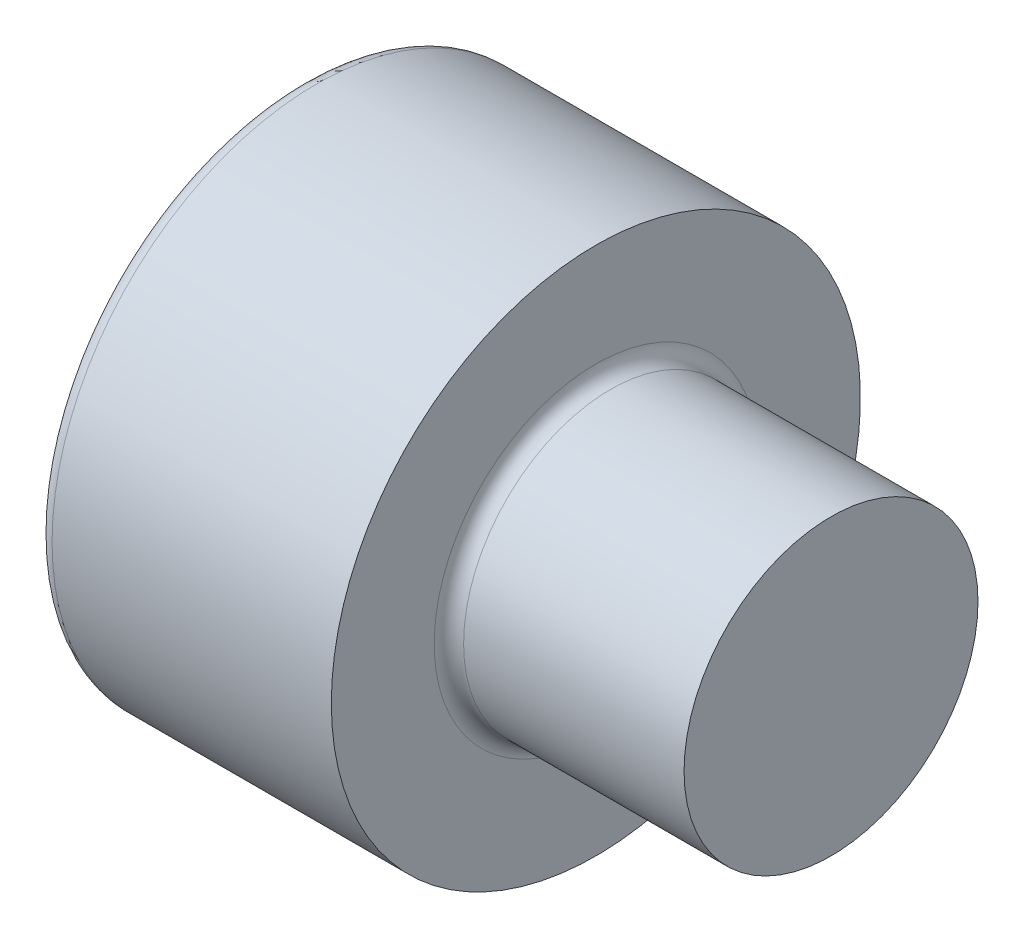
ISO-10303-21;
HEADER;
FILE_DESCRIPTION(('STEP AP214'),'2;1');
FILE_NAME('part.step','',(''),(''),'','','');
FILE_SCHEMA(('AUTOMOTIVE_DESIGN { 1 0 10303 214 1 1 1 1 }'));
ENDSEC;
DATA;
#1=APPLICATION_CONTEXT('core data for automotive mechanical design processes');
#2=APPLICATION_PROTOCOL_DEFINITION('international standard','automotive_design',2000,#1);
#3=PRODUCT_CONTEXT('',#1,'mechanical');
#4=PRODUCT('Part','Part','',(#3));
#5=PRODUCT_RELATED_PRODUCT_CATEGORY('part','',(#4));
#6=PRODUCT_DEFINITION_FORMATION('','',#4);
#7=PRODUCT_DEFINITION_CONTEXT('part definition',#1,'design');
#8=PRODUCT_DEFINITION('design','',#6,#7);
#9=PRODUCT_DEFINITION_SHAPE('','',#8);
#10=(LENGTH_UNIT() NAMED_UNIT(*) SI_UNIT(.MILLI.,.METRE.));
#11=(NAMED_UNIT(*) PLANE_ANGLE_UNIT() SI_UNIT($,.RADIAN.));
#12=(NAMED_UNIT(*) SI_UNIT($,.STERADIAN.) SOLID_ANGLE_UNIT());
#13=UNCERTAINTY_MEASURE_WITH_UNIT(LENGTH_MEASURE(1.E-05),#10,'distance_accuracy_value','');
#14=(GEOMETRIC_REPRESENTATION_CONTEXT(3) GLOBAL_UNCERTAINTY_ASSIGNED_CONTEXT((#13)) GLOBAL_UNIT_ASSIGNED_CONTEXT((#10,
#11,#12)) REPRESENTATION_CONTEXT('',''));
#15=CARTESIAN_POINT('',(0.,0.,0.));
#16=DIRECTION('',(0.,0.,1.));
#17=DIRECTION('',(1.,0.,0.));
#18=AXIS2_PLACEMENT_3D('',#15,#16,#17);
#19=CARTESIAN_POINT('',(10.5,0.,0.));
#20=DIRECTION('',(-1.,0.,0.));
#21=DIRECTION('',(0.,0.,1.));
#22=AXIS2_PLACEMENT_3D('',#19,#20,#21);
#23=CYLINDRICAL_SURFACE('',#22,1.25);
#24=CARTESIAN_POINT('',(2.625,0.,0.));
#25=DIRECTION('',(1.,0.,0.));
#26=DIRECTION('',(0.,0.,-1.));
#27=AXIS2_PLACEMENT_3D('',#24,#25,#26);
#28=CIRCLE('',#27,1.25);
#29=CARTESIAN_POINT('',(2.625,0.,-1.25));
#30=VERTEX_POINT('',#29);
#31=EDGE_CURVE('E174',#30,#30,#28,.T.);
#32=ORIENTED_EDGE('',*,*,#31,.T.);
#33=EDGE_LOOP('',(#32));
#34=FACE_BOUND('',#33,.T.);
#35=CARTESIAN_POINT('',(4.5,0.,0.));
#36=DIRECTION('',(1.,0.,0.));
#37=DIRECTION('',(0.,0.,-1.));
#38=AXIS2_PLACEMENT_3D('',#35,#36,#37);
#39=CIRCLE('',#38,1.25);
#40=CARTESIAN_POINT('',(4.5,0.,-1.25));
#41=VERTEX_POINT('',#40);
#42=EDGE_CURVE('E39',#41,#41,#39,.T.);
#43=ORIENTED_EDGE('',*,*,#42,.F.);
#44=EDGE_LOOP('',(#43));
#45=FACE_BOUND('',#44,.T.);
#46=ADVANCED_FACE('F35',(#34,#45),#23,.T.);
#47=CARTESIAN_POINT('',(1.1,0.,0.));
#48=DIRECTION('',(-1.,0.,0.));
#49=DIRECTION('',(0.,0.,1.));
#50=AXIS2_PLACEMENT_3D('',#47,#48,#49);
#51=PLANE('',#50);
#52=DIRECTION('',(0.,-1.,0.));
#53=VECTOR('',#52,1.);
#54=CARTESIAN_POINT('',(1.1,0.590340650246388,-1.0225));
#55=LINE('',#54,#53);
#56=CARTESIAN_POINT('',(1.1,0.590340650246388,-1.0225));
#57=VERTEX_POINT('',#56);
#58=CARTESIAN_POINT('',(1.10000000000581,0.,-1.0225));
#59=VERTEX_POINT('',#58);
#60=EDGE_CURVE('E226',#57,#59,#55,.T.);
#61=ORIENTED_EDGE('',*,*,#60,.T.);
#62=CARTESIAN_POINT('',(1.10000000000581,0.,0.));
#63=DIRECTION('',(1.,0.,0.));
#64=DIRECTION('',(0.,0.,-1.));
#65=AXIS2_PLACEMENT_3D('',#62,#63,#64);
#66=CIRCLE('',#65,1.02250000003191);
#67=CARTESIAN_POINT('',(1.10000000000581,0.885510975397226,-0.511250000015958));
#68=VERTEX_POINT('',#67);
#69=EDGE_CURVE('E51',#59,#68,#66,.T.);
#70=ORIENTED_EDGE('',*,*,#69,.T.);
#71=DIRECTION('',(0.,-0.500000000000001,-0.866025403784438));
#72=VECTOR('',#71,1.);
#73=CARTESIAN_POINT('',(1.1,1.18068130049278,0.));
#74=LINE('',#73,#72);
#75=EDGE_CURVE('E239',#68,#57,#74,.T.);
#76=ORIENTED_EDGE('',*,*,#75,.T.);
#77=EDGE_LOOP('',(#61,#70,#76));
#78=FACE_BOUND('',#77,.T.);
#79=ADVANCED_FACE('F122',(#78),#51,.T.);
#80=CARTESIAN_POINT('',(1.1,1.18068130049278,0.));
#81=VERTEX_POINT('',#80);
#82=EDGE_CURVE('E240',#81,#68,#74,.T.);
#83=ORIENTED_EDGE('',*,*,#82,.T.);
#84=CARTESIAN_POINT('',(1.10000000000581,0.885510975397227,0.511250000015956));
#85=VERTEX_POINT('',#84);
#86=EDGE_CURVE('E177',#68,#85,#66,.T.);
#87=ORIENTED_EDGE('',*,*,#86,.T.);
#88=DIRECTION('',(0.,0.499999999999999,-0.866025403784439));
#89=VECTOR('',#88,1.);
#90=CARTESIAN_POINT('',(1.1,0.59034065024639,1.0225));
#91=LINE('',#90,#89);
#92=EDGE_CURVE('E236',#85,#81,#91,.T.);
#93=ORIENTED_EDGE('',*,*,#92,.T.);
#94=EDGE_LOOP('',(#83,#87,#93));
#95=FACE_BOUND('',#94,.T.);
#96=ADVANCED_FACE('F133',(#95),#51,.T.);
#97=CARTESIAN_POINT('',(1.1,0.59034065024639,1.0225));
#98=VERTEX_POINT('',#97);
#99=EDGE_CURVE('E237',#98,#85,#91,.T.);
#100=ORIENTED_EDGE('',*,*,#99,.T.);
#101=CARTESIAN_POINT('',(1.10000000000581,0.,1.02250000003191));
#102=VERTEX_POINT('',#101);
#103=EDGE_CURVE('E200',#85,#102,#66,.T.);
#104=ORIENTED_EDGE('',*,*,#103,.T.);
#105=DIRECTION('',(0.,1.,0.));
#106=VECTOR('',#105,1.);
#107=CARTESIAN_POINT('',(1.1,-0.590340650246394,1.0225));
#108=LINE('',#107,#106);
#109=EDGE_CURVE('E233',#102,#98,#108,.T.);
#110=ORIENTED_EDGE('',*,*,#109,.T.);
#111=EDGE_LOOP('',(#100,#104,#110));
#112=FACE_BOUND('',#111,.T.);
#113=ADVANCED_FACE('F272',(#112),#51,.T.);
#114=CARTESIAN_POINT('',(1.1,-0.590340650246394,1.0225));
#115=VERTEX_POINT('',#114);
#116=EDGE_CURVE('E234',#115,#102,#108,.T.);
#117=ORIENTED_EDGE('',*,*,#116,.T.);
#118=CARTESIAN_POINT('',(1.10000000000581,-0.885510975397226,0.511250000015958));
#119=VERTEX_POINT('',#118);
#120=EDGE_CURVE('E205',#102,#119,#66,.T.);
#121=ORIENTED_EDGE('',*,*,#120,.T.);
#122=DIRECTION('',(0.,0.500000000000001,0.866025403784438));
#123=VECTOR('',#122,1.);
#124=CARTESIAN_POINT('',(1.1,-1.18068130049279,0.));
#125=LINE('',#124,#123);
#126=EDGE_CURVE('E230',#119,#115,#125,.T.);
#127=ORIENTED_EDGE('',*,*,#126,.T.);
#128=EDGE_LOOP('',(#117,#121,#127));
#129=FACE_BOUND('',#128,.T.);
#130=ADVANCED_FACE('F155',(#129),#51,.T.);
#131=CARTESIAN_POINT('',(1.1,-1.18068130049279,0.));
#132=VERTEX_POINT('',#131);
#133=EDGE_CURVE('E219',#132,#119,#125,.T.);
#134=ORIENTED_EDGE('',*,*,#133,.T.);
#135=CARTESIAN_POINT('',(1.10000000000581,-0.885510975397228,-0.511250000015955));
#136=VERTEX_POINT('',#135);
#137=EDGE_CURVE('E166',#119,#136,#66,.T.);
#138=ORIENTED_EDGE('',*,*,#137,.T.);
#139=DIRECTION('',(0.,-0.499999999999999,0.86602540378444));
#140=VECTOR('',#139,1.);
#141=CARTESIAN_POINT('',(1.1,-0.590340650246397,-1.0225));
#142=LINE('',#141,#140);
#143=EDGE_CURVE('E216',#136,#132,#142,.T.);
#144=ORIENTED_EDGE('',*,*,#143,.T.);
#145=EDGE_LOOP('',(#134,#138,#144));
#146=FACE_BOUND('',#145,.T.);
#147=ADVANCED_FACE('F123',(#146),#51,.T.);
#148=CARTESIAN_POINT('',(2.5,0.,0.));
#149=DIRECTION('',(-1.,0.,0.));
#150=DIRECTION('',(0.,0.,1.));
#151=AXIS2_PLACEMENT_3D('',#148,#149,#150);
#152=CYLINDRICAL_SURFACE('',#151,2.25);
#153=CARTESIAN_POINT('',(0.125,0.,0.));
#154=DIRECTION('',(-1.,0.,0.));
#155=DIRECTION('',(0.,0.,1.));
#156=AXIS2_PLACEMENT_3D('',#153,#154,#155);
#157=CIRCLE('',#156,2.25);
#158=CARTESIAN_POINT('',(0.125,0.,2.25));
#159=VERTEX_POINT('',#158);
#160=EDGE_CURVE('E11',#159,#159,#157,.F.);
#161=ORIENTED_EDGE('',*,*,#160,.T.);
#162=EDGE_LOOP('',(#161));
#163=FACE_BOUND('',#162,.T.);
#164=CARTESIAN_POINT('',(2.5,0.,0.));
#165=DIRECTION('',(-1.,0.,0.));
#166=DIRECTION('',(0.,0.,1.));
#167=AXIS2_PLACEMENT_3D('',#164,#165,#166);
#168=CIRCLE('',#167,2.25);
#169=CARTESIAN_POINT('',(2.5,0.,2.25));
#170=VERTEX_POINT('',#169);
#171=EDGE_CURVE('E161',#170,#170,#168,.T.);
#172=ORIENTED_EDGE('',*,*,#171,.T.);
#173=EDGE_LOOP('',(#172));
#174=FACE_BOUND('',#173,.T.);
#175=ADVANCED_FACE('F148',(#163,#174),#152,.T.);
#176=CARTESIAN_POINT('',(2.5,2.25,0.));
#177=DIRECTION('',(1.,0.,0.));
#178=DIRECTION('',(0.,0.,-1.));
#179=AXIS2_PLACEMENT_3D('',#176,#177,#178);
#180=PLANE('',#179);
#181=CARTESIAN_POINT('',(2.5,0.,0.));
#182=DIRECTION('',(1.,0.,0.));
#183=DIRECTION('',(0.,0.,-1.));
#184=AXIS2_PLACEMENT_3D('',#181,#182,#183);
#185=CIRCLE('',#184,1.375);
#186=CARTESIAN_POINT('',(2.5,0.,-1.375));
#187=VERTEX_POINT('',#186);
#188=EDGE_CURVE('E176',#187,#187,#185,.F.);
#189=ORIENTED_EDGE('',*,*,#188,.T.);
#190=EDGE_LOOP('',(#189));
#191=FACE_BOUND('',#190,.T.);
#192=ORIENTED_EDGE('',*,*,#171,.F.);
#193=EDGE_LOOP('',(#192));
#194=FACE_BOUND('',#193,.T.);
#195=ADVANCED_FACE('F144',(#191,#194),#180,.T.);
#196=CARTESIAN_POINT('',(0.,0.,0.));
#197=DIRECTION('',(-1.,0.,0.));
#198=DIRECTION('',(0.,0.,1.));
#199=AXIS2_PLACEMENT_3D('',#196,#197,#198);
#200=PLANE('',#199);
#201=CARTESIAN_POINT('',(0.,0.,0.));
#202=DIRECTION('',(-1.,0.,0.));
#203=DIRECTION('',(0.,0.,1.));
#204=AXIS2_PLACEMENT_3D('',#201,#202,#203);
#205=CIRCLE('',#204,2.125);
#206=CARTESIAN_POINT('',(0.,0.,2.125));
#207=VERTEX_POINT('',#206);
#208=EDGE_CURVE('E44',#207,#207,#205,.T.);
#209=ORIENTED_EDGE('',*,*,#208,.T.);
#210=EDGE_LOOP('',(#209));
#211=FACE_BOUND('',#210,.T.);
#212=DIRECTION('',(0.,-1.,0.));
#213=VECTOR('',#212,1.);
#214=CARTESIAN_POINT('',(0.,0.590340650246388,-1.0225));
#215=LINE('',#214,#213);
#216=CARTESIAN_POINT('',(0.,0.590340650246388,-1.0225));
#217=VERTEX_POINT('',#216);
#218=CARTESIAN_POINT('',(0.,-0.590340650246397,-1.0225));
#219=VERTEX_POINT('',#218);
#220=EDGE_CURVE('E59',#217,#219,#215,.T.);
#221=ORIENTED_EDGE('',*,*,#220,.F.);
#222=DIRECTION('',(0.,-0.500000000000001,-0.866025403784438));
#223=VECTOR('',#222,1.);
#224=CARTESIAN_POINT('',(0.,1.18068130049278,0.));
#225=LINE('',#224,#223);
#226=CARTESIAN_POINT('',(0.,1.18068130049278,0.));
#227=VERTEX_POINT('',#226);
#228=EDGE_CURVE('E252',#227,#217,#225,.T.);
#229=ORIENTED_EDGE('',*,*,#228,.F.);
#230=DIRECTION('',(0.,0.499999999999999,-0.866025403784439));
#231=VECTOR('',#230,1.);
#232=CARTESIAN_POINT('',(0.,0.59034065024639,1.0225));
#233=LINE('',#232,#231);
#234=CARTESIAN_POINT('',(0.,0.59034065024639,1.0225));
#235=VERTEX_POINT('',#234);
#236=EDGE_CURVE('E249',#235,#227,#233,.T.);
#237=ORIENTED_EDGE('',*,*,#236,.F.);
#238=DIRECTION('',(0.,1.,0.));
#239=VECTOR('',#238,1.);
#240=CARTESIAN_POINT('',(0.,-0.590340650246394,1.0225));
#241=LINE('',#240,#239);
#242=CARTESIAN_POINT('',(0.,-0.590340650246394,1.0225));
#243=VERTEX_POINT('',#242);
#244=EDGE_CURVE('E246',#243,#235,#241,.T.);
#245=ORIENTED_EDGE('',*,*,#244,.F.);
#246=DIRECTION('',(0.,0.500000000000001,0.866025403784438));
#247=VECTOR('',#246,1.);
#248=CARTESIAN_POINT('',(0.,-1.18068130049279,0.));
#249=LINE('',#248,#247);
#250=CARTESIAN_POINT('',(0.,-1.18068130049279,0.));
#251=VERTEX_POINT('',#250);
#252=EDGE_CURVE('E243',#251,#243,#249,.T.);
#253=ORIENTED_EDGE('',*,*,#252,.F.);
#254=DIRECTION('',(0.,-0.499999999999999,0.86602540378444));
#255=VECTOR('',#254,1.);
#256=CARTESIAN_POINT('',(0.,-0.590340650246397,-1.0225));
#257=LINE('',#256,#255);
#258=EDGE_CURVE('E196',#219,#251,#257,.T.);
#259=ORIENTED_EDGE('',*,*,#258,.F.);
#260=EDGE_LOOP('',(#221,#229,#237,#245,#253,#259));
#261=FACE_BOUND('',#260,.T.);
#262=ADVANCED_FACE('F141',(#211,#261),#200,.T.);
#263=CARTESIAN_POINT('',(1.1,0.590340650246388,-1.0225));
#264=DIRECTION('',(0.,0.,-1.));
#265=DIRECTION('',(0.,1.,0.));
#266=AXIS2_PLACEMENT_3D('',#263,#264,#265);
#267=PLANE('',#266);
#268=ORIENTED_EDGE('',*,*,#220,.T.);
#269=DIRECTION('',(-1.,0.,0.));
#270=VECTOR('',#269,1.);
#271=CARTESIAN_POINT('',(1.1,-0.590340650246397,-1.0225));
#272=LINE('',#271,#270);
#273=CARTESIAN_POINT('',(1.1,-0.590340650246397,-1.0225));
#274=VERTEX_POINT('',#273);
#275=EDGE_CURVE('E172',#274,#219,#272,.T.);
#276=ORIENTED_EDGE('',*,*,#275,.F.);
#277=EDGE_CURVE('E229',#59,#274,#55,.T.);
#278=ORIENTED_EDGE('',*,*,#277,.F.);
#279=ORIENTED_EDGE('',*,*,#60,.F.);
#280=DIRECTION('',(-1.,0.,0.));
#281=VECTOR('',#280,1.);
#282=CARTESIAN_POINT('',(1.1,0.590340650246388,-1.0225));
#283=LINE('',#282,#281);
#284=EDGE_CURVE('E164',#57,#217,#283,.T.);
#285=ORIENTED_EDGE('',*,*,#284,.T.);
#286=EDGE_LOOP('',(#268,#276,#278,#279,#285));
#287=FACE_BOUND('',#286,.T.);
#288=ADVANCED_FACE('F139',(#287),#267,.F.);
#289=CARTESIAN_POINT('',(1.1,1.18068130049278,0.));
#290=DIRECTION('',(0.,0.866025403784438,-0.500000000000001));
#291=DIRECTION('',(0.,0.500000000000001,0.866025403784438));
#292=AXIS2_PLACEMENT_3D('',#289,#290,#291);
#293=PLANE('',#292);
#294=ORIENTED_EDGE('',*,*,#228,.T.);
#295=ORIENTED_EDGE('',*,*,#284,.F.);
#296=ORIENTED_EDGE('',*,*,#75,.F.);
#297=ORIENTED_EDGE('',*,*,#82,.F.);
#298=DIRECTION('',(-1.,0.,0.));
#299=VECTOR('',#298,1.);
#300=CARTESIAN_POINT('',(1.1,1.18068130049278,0.));
#301=LINE('',#300,#299);
#302=EDGE_CURVE('E168',#81,#227,#301,.T.);
#303=ORIENTED_EDGE('',*,*,#302,.T.);
#304=EDGE_LOOP('',(#294,#295,#296,#297,#303));
#305=FACE_BOUND('',#304,.T.);
#306=ADVANCED_FACE('F277',(#305),#293,.F.);
#307=CARTESIAN_POINT('',(1.1,0.59034065024639,1.0225));
#308=DIRECTION('',(0.,0.866025403784439,0.5));
#309=DIRECTION('',(0.,-0.5,0.866025403784439));
#310=AXIS2_PLACEMENT_3D('',#307,#308,#309);
#311=PLANE('',#310);
#312=ORIENTED_EDGE('',*,*,#236,.T.);
#313=ORIENTED_EDGE('',*,*,#302,.F.);
#314=ORIENTED_EDGE('',*,*,#92,.F.);
#315=ORIENTED_EDGE('',*,*,#99,.F.);
#316=DIRECTION('',(-1.,0.,0.));
#317=VECTOR('',#316,1.);
#318=CARTESIAN_POINT('',(1.1,0.59034065024639,1.0225));
#319=LINE('',#318,#317);
#320=EDGE_CURVE('E256',#98,#235,#319,.T.);
#321=ORIENTED_EDGE('',*,*,#320,.T.);
#322=EDGE_LOOP('',(#312,#313,#314,#315,#321));
#323=FACE_BOUND('',#322,.T.);
#324=ADVANCED_FACE('F280',(#323),#311,.F.);
#325=CARTESIAN_POINT('',(1.1,-0.590340650246394,1.0225));
#326=DIRECTION('',(0.,0.,1.));
#327=DIRECTION('',(0.,-1.,0.));
#328=AXIS2_PLACEMENT_3D('',#325,#326,#327);
#329=PLANE('',#328);
#330=ORIENTED_EDGE('',*,*,#244,.T.);
#331=ORIENTED_EDGE('',*,*,#320,.F.);
#332=ORIENTED_EDGE('',*,*,#109,.F.);
#333=ORIENTED_EDGE('',*,*,#116,.F.);
#334=DIRECTION('',(-1.,0.,0.));
#335=VECTOR('',#334,1.);
#336=CARTESIAN_POINT('',(1.1,-0.590340650246394,1.0225));
#337=LINE('',#336,#335);
#338=EDGE_CURVE('E258',#115,#243,#337,.T.);
#339=ORIENTED_EDGE('',*,*,#338,.T.);
#340=EDGE_LOOP('',(#330,#331,#332,#333,#339));
#341=FACE_BOUND('',#340,.T.);
#342=ADVANCED_FACE('F269',(#341),#329,.F.);
#343=CARTESIAN_POINT('',(1.1,-1.18068130049279,0.));
#344=DIRECTION('',(0.,-0.866025403784438,0.500000000000001));
#345=DIRECTION('',(0.,-0.500000000000001,-0.866025403784438));
#346=AXIS2_PLACEMENT_3D('',#343,#344,#345);
#347=PLANE('',#346);
#348=ORIENTED_EDGE('',*,*,#252,.T.);
#349=ORIENTED_EDGE('',*,*,#338,.F.);
#350=ORIENTED_EDGE('',*,*,#126,.F.);
#351=ORIENTED_EDGE('',*,*,#133,.F.);
#352=DIRECTION('',(-1.,0.,0.));
#353=VECTOR('',#352,1.);
#354=CARTESIAN_POINT('',(1.1,-1.18068130049279,0.));
#355=LINE('',#354,#353);
#356=EDGE_CURVE('E225',#132,#251,#355,.T.);
#357=ORIENTED_EDGE('',*,*,#356,.T.);
#358=EDGE_LOOP('',(#348,#349,#350,#351,#357));
#359=FACE_BOUND('',#358,.T.);
#360=ADVANCED_FACE('F266',(#359),#347,.F.);
#361=CARTESIAN_POINT('',(1.1,-0.590340650246397,-1.0225));
#362=DIRECTION('',(0.,-0.86602540378444,-0.499999999999998));
#363=DIRECTION('',(0.,0.499999999999998,-0.86602540378444));
#364=AXIS2_PLACEMENT_3D('',#361,#362,#363);
#365=PLANE('',#364);
#366=ORIENTED_EDGE('',*,*,#258,.T.);
#367=ORIENTED_EDGE('',*,*,#356,.F.);
#368=ORIENTED_EDGE('',*,*,#143,.F.);
#369=EDGE_CURVE('E224',#274,#136,#142,.T.);
#370=ORIENTED_EDGE('',*,*,#369,.F.);
#371=ORIENTED_EDGE('',*,*,#275,.T.);
#372=EDGE_LOOP('',(#366,#367,#368,#370,#371));
#373=FACE_BOUND('',#372,.T.);
#374=ADVANCED_FACE('F119',(#373),#365,.F.);
#375=ORIENTED_EDGE('',*,*,#369,.T.);
#376=EDGE_CURVE('E163',#136,#59,#66,.T.);
#377=ORIENTED_EDGE('',*,*,#376,.T.);
#378=ORIENTED_EDGE('',*,*,#277,.T.);
#379=EDGE_LOOP('',(#375,#377,#378));
#380=FACE_BOUND('',#379,.T.);
#381=ADVANCED_FACE('F112',(#380),#51,.T.);
#382=CARTESIAN_POINT('',(1.69034065027063,0.,0.));
#383=DIRECTION('',(-1.,0.,0.));
#384=DIRECTION('',(0.,0.,1.));
#385=AXIS2_PLACEMENT_3D('',#382,#383,#384);
#386=CONICAL_SURFACE('',#385,0.,1.0471975511966);
#387=ORIENTED_EDGE('',*,*,#69,.F.);
#388=ORIENTED_EDGE('',*,*,#376,.F.);
#389=ORIENTED_EDGE('',*,*,#137,.F.);
#390=ORIENTED_EDGE('',*,*,#120,.F.);
#391=ORIENTED_EDGE('',*,*,#103,.F.);
#392=ORIENTED_EDGE('',*,*,#86,.F.);
#393=EDGE_LOOP('',(#387,#388,#389,#390,#391,#392));
#394=FACE_BOUND('',#393,.T.);
#395=CARTESIAN_POINT('',(1.69034065027063,0.,0.));
#396=VERTEX_POINT('',#395);
#397=VERTEX_LOOP('',#396);
#398=FACE_BOUND('',#397,.T.);
#399=ADVANCED_FACE('F109',(#394,#398),#386,.F.);
#400=CARTESIAN_POINT('',(2.625,0.,0.));
#401=DIRECTION('',(1.,0.,0.));
#402=DIRECTION('',(0.,0.,-1.));
#403=AXIS2_PLACEMENT_3D('',#400,#401,#402);
#404=TOROIDAL_SURFACE('',#403,1.375,0.125);
#405=ORIENTED_EDGE('',*,*,#188,.F.);
#406=EDGE_LOOP('',(#405));
#407=FACE_BOUND('',#406,.T.);
#408=ORIENTED_EDGE('',*,*,#31,.F.);
#409=EDGE_LOOP('',(#408));
#410=FACE_BOUND('',#409,.T.);
#411=ADVANCED_FACE('F111',(#407,#410),#404,.F.);
#412=CARTESIAN_POINT('',(0.125,0.,0.));
#413=DIRECTION('',(-1.,0.,0.));
#414=DIRECTION('',(0.,0.,1.));
#415=AXIS2_PLACEMENT_3D('',#412,#413,#414);
#416=TOROIDAL_SURFACE('',#415,2.125,0.125);
#417=ORIENTED_EDGE('',*,*,#160,.F.);
#418=EDGE_LOOP('',(#417));
#419=FACE_BOUND('',#418,.T.);
#420=ORIENTED_EDGE('',*,*,#208,.F.);
#421=EDGE_LOOP('',(#420));
#422=FACE_BOUND('',#421,.T.);
#423=ADVANCED_FACE('F37',(#419,#422),#416,.T.);
#424=CARTESIAN_POINT('',(4.5,-2.7089585150932,10.));
#425=DIRECTION('',(1.,0.,0.));
#426=DIRECTION('',(0.,0.,-1.));
#427=AXIS2_PLACEMENT_3D('',#424,#425,#426);
#428=PLANE('',#427);
#429=ORIENTED_EDGE('',*,*,#42,.T.);
#430=EDGE_LOOP('',(#429));
#431=FACE_BOUND('',#430,.T.);
#432=ADVANCED_FACE('F185',(#431),#428,.T.);
#433=CLOSED_SHELL('',(#46,#79,#96,#113,#130,#147,#175,#195,#262,#288,#306,#324,#342,#360,#374,
#381,#399,#411,#423,#432));
#434=MANIFOLD_SOLID_BREP('B2',#433);
#435=ADVANCED_BREP_SHAPE_REPRESENTATION('',(#18,#434),#14);
#436=SHAPE_DEFINITION_REPRESENTATION(#9,#435);
ENDSEC;
END-ISO-10303-21;
